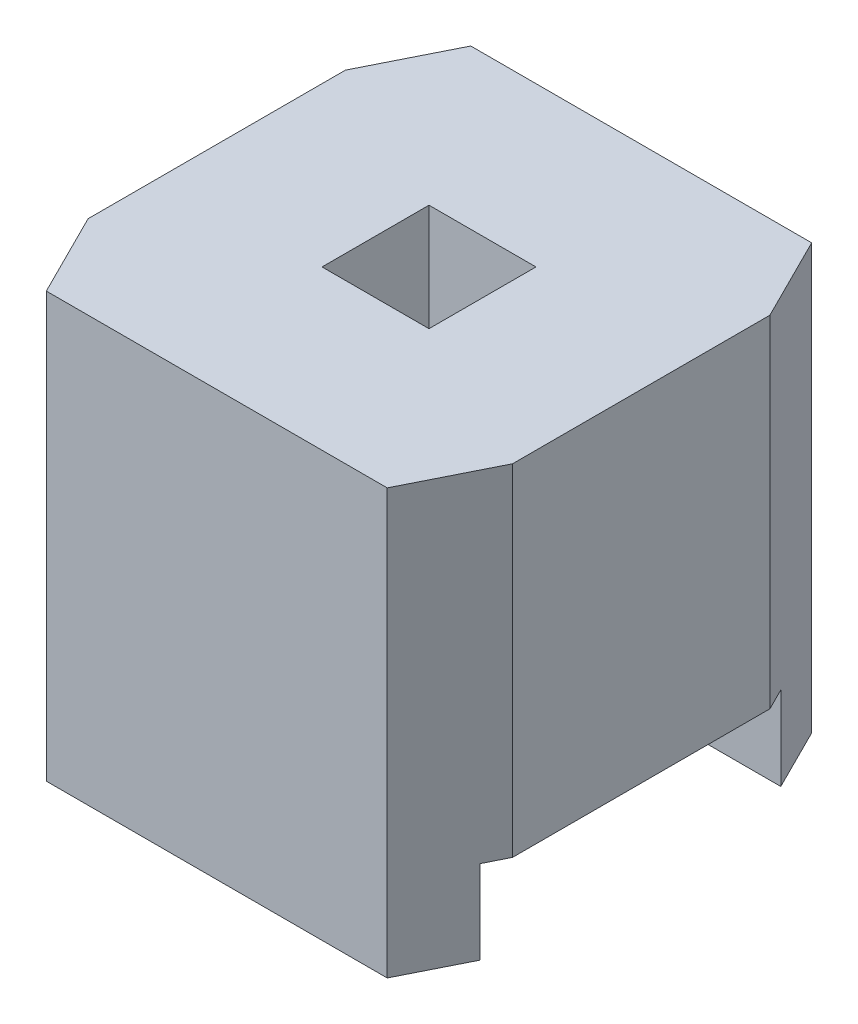
ISO-10303-21;
HEADER;
FILE_DESCRIPTION(('STEP AP214'),'2;1');
FILE_NAME('part.step','',(''),(''),'','','');
FILE_SCHEMA(('AUTOMOTIVE_DESIGN { 1 0 10303 214 1 1 1 1 }'));
ENDSEC;
DATA;
#1=APPLICATION_CONTEXT('core data for automotive mechanical design processes');
#2=APPLICATION_PROTOCOL_DEFINITION('international standard','automotive_design',2000,#1);
#3=PRODUCT_CONTEXT('',#1,'mechanical');
#4=PRODUCT('Part','Part','',(#3));
#5=PRODUCT_RELATED_PRODUCT_CATEGORY('part','',(#4));
#6=PRODUCT_DEFINITION_FORMATION('','',#4);
#7=PRODUCT_DEFINITION_CONTEXT('part definition',#1,'design');
#8=PRODUCT_DEFINITION('design','',#6,#7);
#9=PRODUCT_DEFINITION_SHAPE('','',#8);
#10=(LENGTH_UNIT() NAMED_UNIT(*) SI_UNIT(.MILLI.,.METRE.));
#11=(NAMED_UNIT(*) PLANE_ANGLE_UNIT() SI_UNIT($,.RADIAN.));
#12=(NAMED_UNIT(*) SI_UNIT($,.STERADIAN.) SOLID_ANGLE_UNIT());
#13=UNCERTAINTY_MEASURE_WITH_UNIT(LENGTH_MEASURE(1.E-05),#10,'distance_accuracy_value','');
#14=(GEOMETRIC_REPRESENTATION_CONTEXT(3) GLOBAL_UNCERTAINTY_ASSIGNED_CONTEXT((#13)) GLOBAL_UNIT_ASSIGNED_CONTEXT((#10,
#11,#12)) REPRESENTATION_CONTEXT('',''));
#15=CARTESIAN_POINT('',(0.,0.,0.));
#16=DIRECTION('',(0.,0.,1.));
#17=DIRECTION('',(1.,0.,0.));
#18=AXIS2_PLACEMENT_3D('',#15,#16,#17);
#19=CARTESIAN_POINT('',(1.27,0.,0.));
#20=DIRECTION('',(-1.,0.,0.));
#21=DIRECTION('',(0.,0.,1.));
#22=AXIS2_PLACEMENT_3D('',#19,#20,#21);
#23=PLANE('',#22);
#24=DIRECTION('',(0.,1.,0.));
#25=VECTOR('',#24,1.);
#26=CARTESIAN_POINT('',(1.27,-3.278329363624,-0.77));
#27=LINE('',#26,#25);
#28=CARTESIAN_POINT('',(1.27,1.27,-0.77));
#29=VERTEX_POINT('',#28);
#30=CARTESIAN_POINT('',(1.27,-0.77,-0.77));
#31=VERTEX_POINT('',#30);
#32=EDGE_CURVE('E143',#29,#31,#27,.F.);
#33=ORIENTED_EDGE('',*,*,#32,.F.);
#34=DIRECTION('',(0.,0.,1.));
#35=VECTOR('',#34,1.);
#36=CARTESIAN_POINT('',(1.27,1.27,0.));
#37=LINE('',#36,#35);
#38=CARTESIAN_POINT('',(1.27,1.27,0.77));
#39=VERTEX_POINT('',#38);
#40=EDGE_CURVE('E20',#39,#29,#37,.F.);
#41=ORIENTED_EDGE('',*,*,#40,.F.);
#42=DIRECTION('',(0.,1.,0.));
#43=VECTOR('',#42,1.);
#44=CARTESIAN_POINT('',(1.27,-3.278329363624,0.77));
#45=LINE('',#44,#43);
#46=CARTESIAN_POINT('',(1.27,-0.77,0.77));
#47=VERTEX_POINT('',#46);
#48=EDGE_CURVE('E172',#47,#39,#45,.T.);
#49=ORIENTED_EDGE('',*,*,#48,.F.);
#50=DIRECTION('',(0.,0.,1.));
#51=VECTOR('',#50,1.);
#52=CARTESIAN_POINT('',(1.27,-0.77,0.));
#53=LINE('',#52,#51);
#54=EDGE_CURVE('E141',#31,#47,#53,.T.);
#55=ORIENTED_EDGE('',*,*,#54,.F.);
#56=EDGE_LOOP('',(#33,#41,#49,#55));
#57=FACE_BOUND('',#56,.T.);
#58=ADVANCED_FACE('F17',(#57),#23,.F.);
#59=CARTESIAN_POINT('',(-1.27,0.,0.));
#60=DIRECTION('',(-1.,0.,0.));
#61=DIRECTION('',(0.,0.,1.));
#62=AXIS2_PLACEMENT_3D('',#59,#60,#61);
#63=PLANE('',#62);
#64=DIRECTION('',(0.,1.,0.));
#65=VECTOR('',#64,1.);
#66=CARTESIAN_POINT('',(-1.27,-3.278329363624,0.77));
#67=LINE('',#66,#65);
#68=CARTESIAN_POINT('',(-1.27,1.27,0.77));
#69=VERTEX_POINT('',#68);
#70=CARTESIAN_POINT('',(-1.27,-0.77,0.77));
#71=VERTEX_POINT('',#70);
#72=EDGE_CURVE('E206',#69,#71,#67,.F.);
#73=ORIENTED_EDGE('',*,*,#72,.F.);
#74=DIRECTION('',(0.,0.,1.));
#75=VECTOR('',#74,1.);
#76=CARTESIAN_POINT('',(-1.27,1.27,0.));
#77=LINE('',#76,#75);
#78=CARTESIAN_POINT('',(-1.27,1.27,-0.77));
#79=VERTEX_POINT('',#78);
#80=EDGE_CURVE('E160',#69,#79,#77,.F.);
#81=ORIENTED_EDGE('',*,*,#80,.T.);
#82=DIRECTION('',(0.,1.,0.));
#83=VECTOR('',#82,1.);
#84=CARTESIAN_POINT('',(-1.27,-3.278329363624,-0.77));
#85=LINE('',#84,#83);
#86=CARTESIAN_POINT('',(-1.27,-0.77,-0.77));
#87=VERTEX_POINT('',#86);
#88=EDGE_CURVE('E229',#87,#79,#85,.T.);
#89=ORIENTED_EDGE('',*,*,#88,.F.);
#90=DIRECTION('',(0.,0.,1.));
#91=VECTOR('',#90,1.);
#92=CARTESIAN_POINT('',(-1.27,-0.77,0.));
#93=LINE('',#92,#91);
#94=EDGE_CURVE('E162',#87,#71,#93,.T.);
#95=ORIENTED_EDGE('',*,*,#94,.T.);
#96=EDGE_LOOP('',(#73,#81,#89,#95));
#97=FACE_BOUND('',#96,.T.);
#98=ADVANCED_FACE('F306',(#97),#63,.T.);
#99=CARTESIAN_POINT('',(-3.129409051225,-1.27,0.9));
#100=DIRECTION('',(0.,0.,-1.));
#101=DIRECTION('',(0.,1.,0.));
#102=AXIS2_PLACEMENT_3D('',#99,#100,#101);
#103=PLANE('',#102);
#104=DIRECTION('',(1.,0.,0.));
#105=VECTOR('',#104,1.);
#106=CARTESIAN_POINT('',(1.27,-1.27,0.9));
#107=LINE('',#106,#105);
#108=CARTESIAN_POINT('',(-1.205,-1.27,0.9));
#109=VERTEX_POINT('',#108);
#110=CARTESIAN_POINT('',(1.205,-1.27,0.9));
#111=VERTEX_POINT('',#110);
#112=EDGE_CURVE('E222',#109,#111,#107,.T.);
#113=ORIENTED_EDGE('',*,*,#112,.F.);
#114=DIRECTION('',(0.,1.,0.));
#115=VECTOR('',#114,1.);
#116=CARTESIAN_POINT('',(-1.205,-3.278329363624,0.9));
#117=LINE('',#116,#115);
#118=CARTESIAN_POINT('',(-1.205,-0.77,0.9));
#119=VERTEX_POINT('',#118);
#120=EDGE_CURVE('E215',#119,#109,#117,.F.);
#121=ORIENTED_EDGE('',*,*,#120,.F.);
#122=DIRECTION('',(1.,0.,0.));
#123=VECTOR('',#122,1.);
#124=CARTESIAN_POINT('',(-3.129409051225,-0.77,0.9));
#125=LINE('',#124,#123);
#126=CARTESIAN_POINT('',(1.205,-0.77,0.9));
#127=VERTEX_POINT('',#126);
#128=EDGE_CURVE('E196',#127,#119,#125,.F.);
#129=ORIENTED_EDGE('',*,*,#128,.F.);
#130=DIRECTION('',(0.,1.,0.));
#131=VECTOR('',#130,1.);
#132=CARTESIAN_POINT('',(1.205,-3.278329363624,0.9));
#133=LINE('',#132,#131);
#134=EDGE_CURVE('E174',#111,#127,#133,.T.);
#135=ORIENTED_EDGE('',*,*,#134,.F.);
#136=EDGE_LOOP('',(#113,#121,#129,#135));
#137=FACE_BOUND('',#136,.T.);
#138=ADVANCED_FACE('F302',(#137),#103,.T.);
#139=CARTESIAN_POINT('',(-3.129409051225,-0.77,-0.9));
#140=DIRECTION('',(0.,0.,1.));
#141=DIRECTION('',(0.,-1.,0.));
#142=AXIS2_PLACEMENT_3D('',#139,#140,#141);
#143=PLANE('',#142);
#144=DIRECTION('',(1.,0.,0.));
#145=VECTOR('',#144,1.);
#146=CARTESIAN_POINT('',(-3.129409051225,-0.77,-0.9));
#147=LINE('',#146,#145);
#148=CARTESIAN_POINT('',(-1.205,-0.77,-0.9));
#149=VERTEX_POINT('',#148);
#150=CARTESIAN_POINT('',(1.205,-0.77,-0.9));
#151=VERTEX_POINT('',#150);
#152=EDGE_CURVE('E185',#149,#151,#147,.T.);
#153=ORIENTED_EDGE('',*,*,#152,.F.);
#154=DIRECTION('',(0.,1.,0.));
#155=VECTOR('',#154,1.);
#156=CARTESIAN_POINT('',(-1.205,-3.278329363624,-0.9));
#157=LINE('',#156,#155);
#158=CARTESIAN_POINT('',(-1.205,-1.27,-0.9));
#159=VERTEX_POINT('',#158);
#160=EDGE_CURVE('E232',#159,#149,#157,.T.);
#161=ORIENTED_EDGE('',*,*,#160,.F.);
#162=DIRECTION('',(1.,0.,0.));
#163=VECTOR('',#162,1.);
#164=CARTESIAN_POINT('',(1.27,-1.27,-0.9));
#165=LINE('',#164,#163);
#166=CARTESIAN_POINT('',(1.205,-1.27,-0.9));
#167=VERTEX_POINT('',#166);
#168=EDGE_CURVE('E154',#167,#159,#165,.F.);
#169=ORIENTED_EDGE('',*,*,#168,.F.);
#170=DIRECTION('',(0.,1.,0.));
#171=VECTOR('',#170,1.);
#172=CARTESIAN_POINT('',(1.205,-3.278329363624,-0.9));
#173=LINE('',#172,#171);
#174=EDGE_CURVE('E125',#151,#167,#173,.F.);
#175=ORIENTED_EDGE('',*,*,#174,.F.);
#176=EDGE_LOOP('',(#153,#161,#169,#175));
#177=FACE_BOUND('',#176,.T.);
#178=ADVANCED_FACE('F313',(#177),#143,.T.);
#179=CARTESIAN_POINT('',(0.32,-3.129409051225,-0.32));
#180=DIRECTION('',(-1.,0.,0.));
#181=DIRECTION('',(0.,0.,1.));
#182=AXIS2_PLACEMENT_3D('',#179,#180,#181);
#183=PLANE('',#182);
#184=DIRECTION('',(0.,1.,0.));
#185=VECTOR('',#184,1.);
#186=CARTESIAN_POINT('',(0.32,-3.129409051225,0.32));
#187=LINE('',#186,#185);
#188=CARTESIAN_POINT('',(0.32,1.27,0.32));
#189=VERTEX_POINT('',#188);
#190=CARTESIAN_POINT('',(0.32,-0.77,0.32));
#191=VERTEX_POINT('',#190);
#192=EDGE_CURVE('E204',#189,#191,#187,.F.);
#193=ORIENTED_EDGE('',*,*,#192,.F.);
#194=DIRECTION('',(0.,0.,1.));
#195=VECTOR('',#194,1.);
#196=CARTESIAN_POINT('',(0.32,1.27,-0.32));
#197=LINE('',#196,#195);
#198=CARTESIAN_POINT('',(0.32,1.27,-0.32));
#199=VERTEX_POINT('',#198);
#200=EDGE_CURVE('E145',#189,#199,#197,.F.);
#201=ORIENTED_EDGE('',*,*,#200,.T.);
#202=DIRECTION('',(0.,-1.,0.));
#203=VECTOR('',#202,1.);
#204=CARTESIAN_POINT('',(0.32,-3.129409051225,-0.32));
#205=LINE('',#204,#203);
#206=CARTESIAN_POINT('',(0.32,-0.77,-0.32));
#207=VERTEX_POINT('',#206);
#208=EDGE_CURVE('E183',#207,#199,#205,.F.);
#209=ORIENTED_EDGE('',*,*,#208,.F.);
#210=DIRECTION('',(0.,0.,-1.));
#211=VECTOR('',#210,1.);
#212=CARTESIAN_POINT('',(0.32,-0.77,0.9));
#213=LINE('',#212,#211);
#214=EDGE_CURVE('E198',#191,#207,#213,.T.);
#215=ORIENTED_EDGE('',*,*,#214,.F.);
#216=EDGE_LOOP('',(#193,#201,#209,#215));
#217=FACE_BOUND('',#216,.T.);
#218=ADVANCED_FACE('F267',(#217),#183,.T.);
#219=CARTESIAN_POINT('',(1.27,-3.278329363624,-0.77));
#220=DIRECTION('',(0.894427190999916,0.,-0.447213595499958));
#221=DIRECTION('',(-0.447213595499958,0.,-0.894427190999916));
#222=AXIS2_PLACEMENT_3D('',#219,#220,#221);
#223=PLANE('',#222);
#224=DIRECTION('',(0.,1.,0.));
#225=VECTOR('',#224,1.);
#226=CARTESIAN_POINT('',(1.02,1.27,-1.27));
#227=LINE('',#226,#225);
#228=CARTESIAN_POINT('',(1.02,1.27,-1.27));
#229=VERTEX_POINT('',#228);
#230=CARTESIAN_POINT('',(1.02,-1.27,-1.27));
#231=VERTEX_POINT('',#230);
#232=EDGE_CURVE('E149',#229,#231,#227,.F.);
#233=ORIENTED_EDGE('',*,*,#232,.F.);
#234=DIRECTION('',(-0.447213595499958,0.,-0.894427190999916));
#235=VECTOR('',#234,1.);
#236=CARTESIAN_POINT('',(1.27,1.27,-0.77));
#237=LINE('',#236,#235);
#238=EDGE_CURVE('E135',#229,#29,#237,.F.);
#239=ORIENTED_EDGE('',*,*,#238,.T.);
#240=ORIENTED_EDGE('',*,*,#32,.T.);
#241=DIRECTION('',(0.447213595499957,0.,0.894427190999916));
#242=VECTOR('',#241,1.);
#243=CARTESIAN_POINT('',(1.205,-0.77,-0.9));
#244=LINE('',#243,#242);
#245=EDGE_CURVE('E171',#151,#31,#244,.T.);
#246=ORIENTED_EDGE('',*,*,#245,.F.);
#247=ORIENTED_EDGE('',*,*,#174,.T.);
#248=DIRECTION('',(0.447213595499958,0.,0.894427190999916));
#249=VECTOR('',#248,1.);
#250=CARTESIAN_POINT('',(1.02,-1.27,-1.27));
#251=LINE('',#250,#249);
#252=EDGE_CURVE('E151',#231,#167,#251,.T.);
#253=ORIENTED_EDGE('',*,*,#252,.F.);
#254=EDGE_LOOP('',(#233,#239,#240,#246,#247,#253));
#255=FACE_BOUND('',#254,.T.);
#256=ADVANCED_FACE('F147',(#255),#223,.T.);
#257=CARTESIAN_POINT('',(1.27,-1.27,-1.27));
#258=DIRECTION('',(0.,-1.,0.));
#259=DIRECTION('',(0.,0.,-1.));
#260=AXIS2_PLACEMENT_3D('',#257,#258,#259);
#261=PLANE('',#260);
#262=DIRECTION('',(-0.447213595499958,0.,0.894427190999916));
#263=VECTOR('',#262,1.);
#264=CARTESIAN_POINT('',(-1.02,-1.27,-1.27));
#265=LINE('',#264,#263);
#266=CARTESIAN_POINT('',(-1.02,-1.27,-1.27));
#267=VERTEX_POINT('',#266);
#268=EDGE_CURVE('E224',#267,#159,#265,.T.);
#269=ORIENTED_EDGE('',*,*,#268,.F.);
#270=DIRECTION('',(-1.,0.,0.));
#271=VECTOR('',#270,1.);
#272=CARTESIAN_POINT('',(1.27,-1.27,-1.27));
#273=LINE('',#272,#271);
#274=EDGE_CURVE('E249',#231,#267,#273,.T.);
#275=ORIENTED_EDGE('',*,*,#274,.F.);
#276=ORIENTED_EDGE('',*,*,#252,.T.);
#277=ORIENTED_EDGE('',*,*,#168,.T.);
#278=EDGE_LOOP('',(#269,#275,#276,#277));
#279=FACE_BOUND('',#278,.T.);
#280=ADVANCED_FACE('F235',(#279),#261,.T.);
#281=CARTESIAN_POINT('',(-1.02,-3.278329363624,-1.27));
#282=DIRECTION('',(-0.894427190999916,0.,-0.447213595499958));
#283=DIRECTION('',(-0.447213595499958,0.,0.894427190999916));
#284=AXIS2_PLACEMENT_3D('',#281,#282,#283);
#285=PLANE('',#284);
#286=DIRECTION('',(0.,1.,0.));
#287=VECTOR('',#286,1.);
#288=CARTESIAN_POINT('',(-1.02,1.27,-1.27));
#289=LINE('',#288,#287);
#290=CARTESIAN_POINT('',(-1.02,1.27,-1.27));
#291=VERTEX_POINT('',#290);
#292=EDGE_CURVE('E244',#267,#291,#289,.T.);
#293=ORIENTED_EDGE('',*,*,#292,.F.);
#294=ORIENTED_EDGE('',*,*,#268,.T.);
#295=ORIENTED_EDGE('',*,*,#160,.T.);
#296=DIRECTION('',(0.447213595499957,0.,-0.894427190999916));
#297=VECTOR('',#296,1.);
#298=CARTESIAN_POINT('',(-1.27,-0.77,-0.77));
#299=LINE('',#298,#297);
#300=EDGE_CURVE('E190',#87,#149,#299,.T.);
#301=ORIENTED_EDGE('',*,*,#300,.F.);
#302=ORIENTED_EDGE('',*,*,#88,.T.);
#303=DIRECTION('',(-0.447213595499958,0.,0.894427190999916));
#304=VECTOR('',#303,1.);
#305=CARTESIAN_POINT('',(-1.02,1.27,-1.27));
#306=LINE('',#305,#304);
#307=EDGE_CURVE('E227',#79,#291,#306,.F.);
#308=ORIENTED_EDGE('',*,*,#307,.T.);
#309=EDGE_LOOP('',(#293,#294,#295,#301,#302,#308));
#310=FACE_BOUND('',#309,.T.);
#311=ADVANCED_FACE('F240',(#310),#285,.T.);
#312=CARTESIAN_POINT('',(1.27,-1.27,-1.27));
#313=DIRECTION('',(0.,-1.,0.));
#314=DIRECTION('',(0.,0.,-1.));
#315=AXIS2_PLACEMENT_3D('',#312,#313,#314);
#316=PLANE('',#315);
#317=DIRECTION('',(0.447213595499958,0.,-0.894427190999916));
#318=VECTOR('',#317,1.);
#319=CARTESIAN_POINT('',(1.02,-1.27,1.27));
#320=LINE('',#319,#318);
#321=CARTESIAN_POINT('',(1.02,-1.27,1.27));
#322=VERTEX_POINT('',#321);
#323=EDGE_CURVE('E220',#322,#111,#320,.T.);
#324=ORIENTED_EDGE('',*,*,#323,.F.);
#325=DIRECTION('',(1.,0.,0.));
#326=VECTOR('',#325,1.);
#327=CARTESIAN_POINT('',(1.27,-1.27,1.27));
#328=LINE('',#327,#326);
#329=CARTESIAN_POINT('',(-1.02,-1.27,1.27));
#330=VERTEX_POINT('',#329);
#331=EDGE_CURVE('E248',#330,#322,#328,.T.);
#332=ORIENTED_EDGE('',*,*,#331,.F.);
#333=DIRECTION('',(0.447213595499958,0.,0.894427190999916));
#334=VECTOR('',#333,1.);
#335=CARTESIAN_POINT('',(-1.27,-1.27,0.77));
#336=LINE('',#335,#334);
#337=EDGE_CURVE('E212',#109,#330,#336,.T.);
#338=ORIENTED_EDGE('',*,*,#337,.F.);
#339=ORIENTED_EDGE('',*,*,#112,.T.);
#340=EDGE_LOOP('',(#324,#332,#338,#339));
#341=FACE_BOUND('',#340,.T.);
#342=ADVANCED_FACE('F297',(#341),#316,.T.);
#343=CARTESIAN_POINT('',(1.02,-3.278329363624,1.27));
#344=DIRECTION('',(0.894427190999916,0.,0.447213595499958));
#345=DIRECTION('',(0.447213595499958,0.,-0.894427190999916));
#346=AXIS2_PLACEMENT_3D('',#343,#344,#345);
#347=PLANE('',#346);
#348=DIRECTION('',(0.447213595499958,0.,-0.894427190999916));
#349=VECTOR('',#348,1.);
#350=CARTESIAN_POINT('',(1.02,1.27,1.27));
#351=LINE('',#350,#349);
#352=CARTESIAN_POINT('',(1.02,1.27,1.27));
#353=VERTEX_POINT('',#352);
#354=EDGE_CURVE('E137',#39,#353,#351,.F.);
#355=ORIENTED_EDGE('',*,*,#354,.T.);
#356=DIRECTION('',(0.,-1.,0.));
#357=VECTOR('',#356,1.);
#358=CARTESIAN_POINT('',(1.02,-1.27,1.27));
#359=LINE('',#358,#357);
#360=EDGE_CURVE('E287',#322,#353,#359,.F.);
#361=ORIENTED_EDGE('',*,*,#360,.F.);
#362=ORIENTED_EDGE('',*,*,#323,.T.);
#363=ORIENTED_EDGE('',*,*,#134,.T.);
#364=DIRECTION('',(-0.447213595499958,0.,0.894427190999916));
#365=VECTOR('',#364,1.);
#366=CARTESIAN_POINT('',(1.27,-0.77,0.77));
#367=LINE('',#366,#365);
#368=EDGE_CURVE('E169',#47,#127,#367,.T.);
#369=ORIENTED_EDGE('',*,*,#368,.F.);
#370=ORIENTED_EDGE('',*,*,#48,.T.);
#371=EDGE_LOOP('',(#355,#361,#362,#363,#369,#370));
#372=FACE_BOUND('',#371,.T.);
#373=ADVANCED_FACE('F177',(#372),#347,.T.);
#374=CARTESIAN_POINT('',(-1.27,-3.278329363624,0.77));
#375=DIRECTION('',(-0.894427190999916,0.,0.447213595499958));
#376=DIRECTION('',(0.447213595499958,0.,0.894427190999916));
#377=AXIS2_PLACEMENT_3D('',#374,#375,#376);
#378=PLANE('',#377);
#379=DIRECTION('',(0.447213595499958,0.,0.894427190999916));
#380=VECTOR('',#379,1.);
#381=CARTESIAN_POINT('',(-1.27,1.27,0.77));
#382=LINE('',#381,#380);
#383=CARTESIAN_POINT('',(-1.02,1.27,1.27));
#384=VERTEX_POINT('',#383);
#385=EDGE_CURVE('E209',#384,#69,#382,.F.);
#386=ORIENTED_EDGE('',*,*,#385,.T.);
#387=ORIENTED_EDGE('',*,*,#72,.T.);
#388=DIRECTION('',(-0.447213595499958,0.,-0.894427190999916));
#389=VECTOR('',#388,1.);
#390=CARTESIAN_POINT('',(-1.205,-0.77,0.9));
#391=LINE('',#390,#389);
#392=EDGE_CURVE('E193',#119,#71,#391,.T.);
#393=ORIENTED_EDGE('',*,*,#392,.F.);
#394=ORIENTED_EDGE('',*,*,#120,.T.);
#395=ORIENTED_EDGE('',*,*,#337,.T.);
#396=DIRECTION('',(0.,-1.,0.));
#397=VECTOR('',#396,1.);
#398=CARTESIAN_POINT('',(-1.02,-1.27,1.27));
#399=LINE('',#398,#397);
#400=EDGE_CURVE('E284',#384,#330,#399,.T.);
#401=ORIENTED_EDGE('',*,*,#400,.F.);
#402=EDGE_LOOP('',(#386,#387,#393,#394,#395,#401));
#403=FACE_BOUND('',#402,.T.);
#404=ADVANCED_FACE('F299',(#403),#378,.T.);
#405=CARTESIAN_POINT('',(0.32,-3.129409051225,0.32));
#406=DIRECTION('',(0.,0.,-1.));
#407=DIRECTION('',(-1.,0.,0.));
#408=AXIS2_PLACEMENT_3D('',#405,#406,#407);
#409=PLANE('',#408);
#410=DIRECTION('',(0.,1.,0.));
#411=VECTOR('',#410,1.);
#412=CARTESIAN_POINT('',(-0.32,-3.129409051225,0.32));
#413=LINE('',#412,#411);
#414=CARTESIAN_POINT('',(-0.32,1.27,0.32));
#415=VERTEX_POINT('',#414);
#416=CARTESIAN_POINT('',(-0.32,-0.77,0.32));
#417=VERTEX_POINT('',#416);
#418=EDGE_CURVE('E273',#415,#417,#413,.F.);
#419=ORIENTED_EDGE('',*,*,#418,.F.);
#420=DIRECTION('',(-1.,0.,0.));
#421=VECTOR('',#420,1.);
#422=CARTESIAN_POINT('',(0.32,1.27,0.32));
#423=LINE('',#422,#421);
#424=EDGE_CURVE('E34',#415,#189,#423,.F.);
#425=ORIENTED_EDGE('',*,*,#424,.T.);
#426=ORIENTED_EDGE('',*,*,#192,.T.);
#427=DIRECTION('',(1.,0.,0.));
#428=VECTOR('',#427,1.);
#429=CARTESIAN_POINT('',(-3.129409051225,-0.77,0.32));
#430=LINE('',#429,#428);
#431=EDGE_CURVE('E200',#417,#191,#430,.T.);
#432=ORIENTED_EDGE('',*,*,#431,.F.);
#433=EDGE_LOOP('',(#419,#425,#426,#432));
#434=FACE_BOUND('',#433,.T.);
#435=ADVANCED_FACE('F330',(#434),#409,.T.);
#436=CARTESIAN_POINT('',(-3.129409051225,-0.77,0.9));
#437=DIRECTION('',(0.,-1.,0.));
#438=DIRECTION('',(0.,0.,-1.));
#439=AXIS2_PLACEMENT_3D('',#436,#437,#438);
#440=PLANE('',#439);
#441=ORIENTED_EDGE('',*,*,#54,.T.);
#442=ORIENTED_EDGE('',*,*,#368,.T.);
#443=ORIENTED_EDGE('',*,*,#128,.T.);
#444=ORIENTED_EDGE('',*,*,#392,.T.);
#445=ORIENTED_EDGE('',*,*,#94,.F.);
#446=ORIENTED_EDGE('',*,*,#300,.T.);
#447=ORIENTED_EDGE('',*,*,#152,.T.);
#448=ORIENTED_EDGE('',*,*,#245,.T.);
#449=EDGE_LOOP('',(#441,#442,#443,#444,#445,#446,#447,#448));
#450=FACE_BOUND('',#449,.T.);
#451=ORIENTED_EDGE('',*,*,#431,.T.);
#452=ORIENTED_EDGE('',*,*,#214,.T.);
#453=DIRECTION('',(1.,0.,0.));
#454=VECTOR('',#453,1.);
#455=CARTESIAN_POINT('',(-0.32,-0.77,-0.32));
#456=LINE('',#455,#454);
#457=CARTESIAN_POINT('',(-0.32,-0.77,-0.32));
#458=VERTEX_POINT('',#457);
#459=EDGE_CURVE('E180',#458,#207,#456,.T.);
#460=ORIENTED_EDGE('',*,*,#459,.F.);
#461=DIRECTION('',(0.,0.,-1.));
#462=VECTOR('',#461,1.);
#463=CARTESIAN_POINT('',(-0.32,-0.77,0.32));
#464=LINE('',#463,#462);
#465=EDGE_CURVE('E276',#417,#458,#464,.T.);
#466=ORIENTED_EDGE('',*,*,#465,.F.);
#467=EDGE_LOOP('',(#451,#452,#460,#466));
#468=FACE_BOUND('',#467,.T.);
#469=ADVANCED_FACE('F165',(#450,#468),#440,.T.);
#470=CARTESIAN_POINT('',(-0.32,-3.129409051225,-0.32));
#471=DIRECTION('',(0.,0.,1.));
#472=DIRECTION('',(0.,-1.,0.));
#473=AXIS2_PLACEMENT_3D('',#470,#471,#472);
#474=PLANE('',#473);
#475=ORIENTED_EDGE('',*,*,#208,.T.);
#476=DIRECTION('',(1.,0.,0.));
#477=VECTOR('',#476,1.);
#478=CARTESIAN_POINT('',(-0.32,1.27,-0.32));
#479=LINE('',#478,#477);
#480=CARTESIAN_POINT('',(-0.32,1.27,-0.32));
#481=VERTEX_POINT('',#480);
#482=EDGE_CURVE('E253',#199,#481,#479,.F.);
#483=ORIENTED_EDGE('',*,*,#482,.T.);
#484=DIRECTION('',(0.,1.,0.));
#485=VECTOR('',#484,1.);
#486=CARTESIAN_POINT('',(-0.32,-3.129409051225,-0.32));
#487=LINE('',#486,#485);
#488=EDGE_CURVE('E274',#458,#481,#487,.T.);
#489=ORIENTED_EDGE('',*,*,#488,.F.);
#490=ORIENTED_EDGE('',*,*,#459,.T.);
#491=EDGE_LOOP('',(#475,#483,#489,#490));
#492=FACE_BOUND('',#491,.T.);
#493=ADVANCED_FACE('F260',(#492),#474,.T.);
#494=CARTESIAN_POINT('',(1.27,1.27,-1.27));
#495=DIRECTION('',(0.,0.,-1.));
#496=DIRECTION('',(-1.,0.,0.));
#497=AXIS2_PLACEMENT_3D('',#494,#495,#496);
#498=PLANE('',#497);
#499=ORIENTED_EDGE('',*,*,#274,.T.);
#500=ORIENTED_EDGE('',*,*,#292,.T.);
#501=DIRECTION('',(1.,0.,0.));
#502=VECTOR('',#501,1.);
#503=CARTESIAN_POINT('',(1.27,1.27,-1.27));
#504=LINE('',#503,#502);
#505=EDGE_CURVE('E277',#229,#291,#504,.F.);
#506=ORIENTED_EDGE('',*,*,#505,.F.);
#507=ORIENTED_EDGE('',*,*,#232,.T.);
#508=EDGE_LOOP('',(#499,#500,#506,#507));
#509=FACE_BOUND('',#508,.T.);
#510=ADVANCED_FACE('F251',(#509),#498,.T.);
#511=CARTESIAN_POINT('',(1.27,-1.27,1.27));
#512=DIRECTION('',(0.,0.,1.));
#513=DIRECTION('',(0.,-1.,0.));
#514=AXIS2_PLACEMENT_3D('',#511,#512,#513);
#515=PLANE('',#514);
#516=DIRECTION('',(1.,0.,0.));
#517=VECTOR('',#516,1.);
#518=CARTESIAN_POINT('',(1.27,1.27,1.27));
#519=LINE('',#518,#517);
#520=EDGE_CURVE('E26',#384,#353,#519,.T.);
#521=ORIENTED_EDGE('',*,*,#520,.F.);
#522=ORIENTED_EDGE('',*,*,#400,.T.);
#523=ORIENTED_EDGE('',*,*,#331,.T.);
#524=ORIENTED_EDGE('',*,*,#360,.T.);
#525=EDGE_LOOP('',(#521,#522,#523,#524));
#526=FACE_BOUND('',#525,.T.);
#527=ADVANCED_FACE('F292',(#526),#515,.T.);
#528=CARTESIAN_POINT('',(-0.32,-3.129409051225,0.32));
#529=DIRECTION('',(1.,0.,0.));
#530=DIRECTION('',(0.,0.,-1.));
#531=AXIS2_PLACEMENT_3D('',#528,#529,#530);
#532=PLANE('',#531);
#533=ORIENTED_EDGE('',*,*,#488,.T.);
#534=DIRECTION('',(0.,0.,1.));
#535=VECTOR('',#534,1.);
#536=CARTESIAN_POINT('',(-0.32,1.27,1.27));
#537=LINE('',#536,#535);
#538=EDGE_CURVE('E11',#415,#481,#537,.F.);
#539=ORIENTED_EDGE('',*,*,#538,.F.);
#540=ORIENTED_EDGE('',*,*,#418,.T.);
#541=ORIENTED_EDGE('',*,*,#465,.T.);
#542=EDGE_LOOP('',(#533,#539,#540,#541));
#543=FACE_BOUND('',#542,.T.);
#544=ADVANCED_FACE('F271',(#543),#532,.T.);
#545=CARTESIAN_POINT('',(1.27,1.27,1.27));
#546=DIRECTION('',(0.,1.,0.));
#547=DIRECTION('',(0.,0.,1.));
#548=AXIS2_PLACEMENT_3D('',#545,#546,#547);
#549=PLANE('',#548);
#550=ORIENTED_EDGE('',*,*,#424,.F.);
#551=ORIENTED_EDGE('',*,*,#538,.T.);
#552=ORIENTED_EDGE('',*,*,#482,.F.);
#553=ORIENTED_EDGE('',*,*,#200,.F.);
#554=EDGE_LOOP('',(#550,#551,#552,#553));
#555=FACE_BOUND('',#554,.T.);
#556=ORIENTED_EDGE('',*,*,#520,.T.);
#557=ORIENTED_EDGE('',*,*,#354,.F.);
#558=ORIENTED_EDGE('',*,*,#40,.T.);
#559=ORIENTED_EDGE('',*,*,#238,.F.);
#560=ORIENTED_EDGE('',*,*,#505,.T.);
#561=ORIENTED_EDGE('',*,*,#307,.F.);
#562=ORIENTED_EDGE('',*,*,#80,.F.);
#563=ORIENTED_EDGE('',*,*,#385,.F.);
#564=EDGE_LOOP('',(#556,#557,#558,#559,#560,#561,#562,#563));
#565=FACE_BOUND('',#564,.T.);
#566=ADVANCED_FACE('F132',(#555,#565),#549,.T.);
#567=CLOSED_SHELL('',(#58,#98,#138,#178,#218,#256,#280,#311,#342,#373,#404,#435,#469,#493,#510,
#527,#544,#566));
#568=MANIFOLD_SOLID_BREP('B1',#567);
#569=ADVANCED_BREP_SHAPE_REPRESENTATION('',(#18,#568),#14);
#570=SHAPE_DEFINITION_REPRESENTATION(#9,#569);
ENDSEC;
END-ISO-10303-21;
